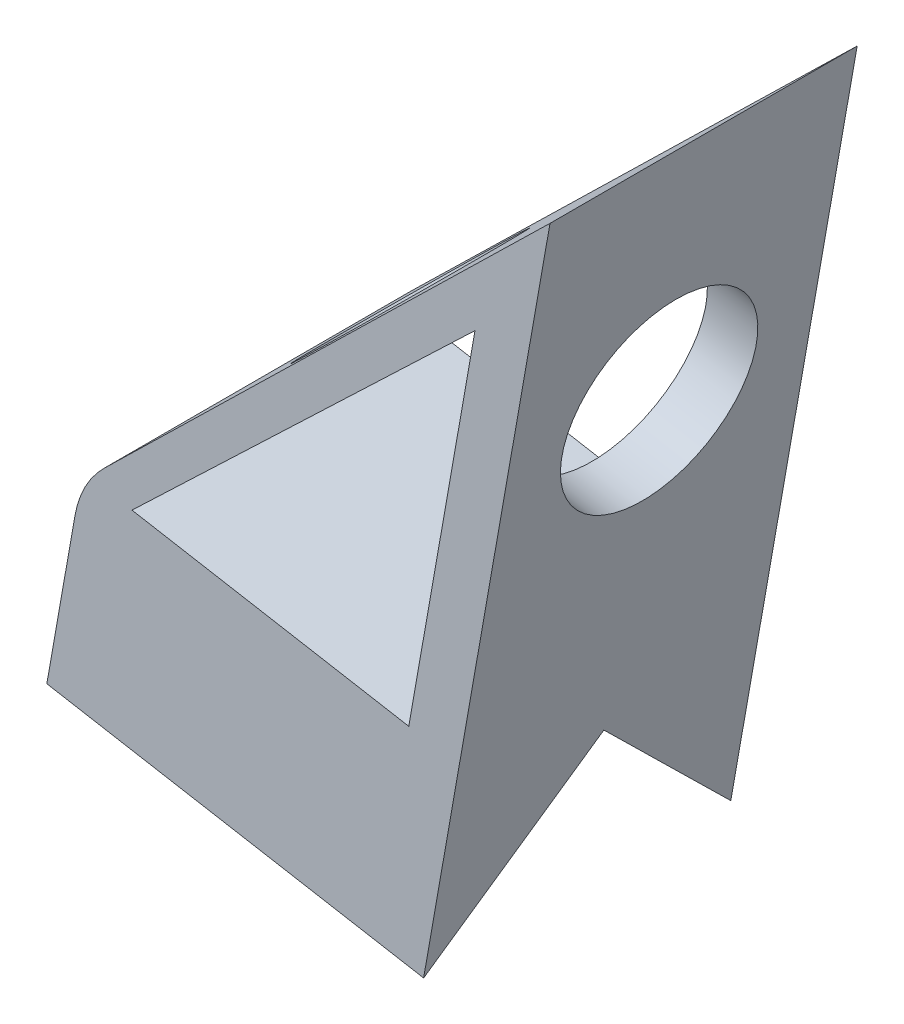
ISO-10303-21;
HEADER;
FILE_DESCRIPTION(('STEP AP214'),'2;1');
FILE_NAME('part.step','',(''),(''),'','','');
FILE_SCHEMA(('AUTOMOTIVE_DESIGN { 1 0 10303 214 1 1 1 1 }'));
ENDSEC;
DATA;
#1=APPLICATION_CONTEXT('core data for automotive mechanical design processes');
#2=APPLICATION_PROTOCOL_DEFINITION('international standard','automotive_design',2000,#1);
#3=PRODUCT_CONTEXT('',#1,'mechanical');
#4=PRODUCT('Part','Part','',(#3));
#5=PRODUCT_RELATED_PRODUCT_CATEGORY('part','',(#4));
#6=PRODUCT_DEFINITION_FORMATION('','',#4);
#7=PRODUCT_DEFINITION_CONTEXT('part definition',#1,'design');
#8=PRODUCT_DEFINITION('design','',#6,#7);
#9=PRODUCT_DEFINITION_SHAPE('','',#8);
#10=(LENGTH_UNIT() NAMED_UNIT(*) SI_UNIT(.MILLI.,.METRE.));
#11=(NAMED_UNIT(*) PLANE_ANGLE_UNIT() SI_UNIT($,.RADIAN.));
#12=(NAMED_UNIT(*) SI_UNIT($,.STERADIAN.) SOLID_ANGLE_UNIT());
#13=UNCERTAINTY_MEASURE_WITH_UNIT(LENGTH_MEASURE(1.E-05),#10,'distance_accuracy_value','');
#14=(GEOMETRIC_REPRESENTATION_CONTEXT(3) GLOBAL_UNCERTAINTY_ASSIGNED_CONTEXT((#13)) GLOBAL_UNIT_ASSIGNED_CONTEXT((#10,
#11,#12)) REPRESENTATION_CONTEXT('',''));
#15=CARTESIAN_POINT('',(0.,0.,0.));
#16=DIRECTION('',(0.,0.,1.));
#17=DIRECTION('',(1.,0.,0.));
#18=AXIS2_PLACEMENT_3D('',#15,#16,#17);
#19=CARTESIAN_POINT('',(0.,203.2,-76.2));
#20=DIRECTION('',(-0.698327101338565,0.715778778349901,0.));
#21=DIRECTION('',(-0.715778778349901,-0.698327101338565,0.));
#22=AXIS2_PLACEMENT_3D('',#19,#20,#21);
#23=PLANE('',#22);
#24=CARTESIAN_POINT('',(-72.7649377372775,132.209172126762,-38.1));
#25=DIRECTION('',(-0.698327101338565,0.715778778349901,0.));
#26=DIRECTION('',(-0.715778778349901,-0.698327101338565,0.));
#27=AXIS2_PLACEMENT_3D('',#24,#25,#26);
#28=CIRCLE('',#27,24.1299999999999);
#29=CARTESIAN_POINT('',(-90.0366796588606,115.358539171463,-38.1));
#30=VERTEX_POINT('',#29);
#31=EDGE_CURVE('E314',#30,#30,#28,.T.);
#32=ORIENTED_EDGE('',*,*,#31,.F.);
#33=EDGE_LOOP('',(#32));
#34=FACE_BOUND('',#33,.T.);
#35=DIRECTION('',(-0.715778778349901,-0.698327101338565,0.));
#36=VECTOR('',#35,1.);
#37=CARTESIAN_POINT('',(0.,203.2,-76.2));
#38=LINE('',#37,#36);
#39=CARTESIAN_POINT('',(0.,203.2,-76.2));
#40=VERTEX_POINT('',#39);
#41=CARTESIAN_POINT('',(-110.542859595178,95.3523282755936,-76.2));
#42=VERTEX_POINT('',#41);
#43=EDGE_CURVE('E201',#40,#42,#38,.T.);
#44=ORIENTED_EDGE('',*,*,#43,.T.);
#45=DIRECTION('',(0.,0.,1.));
#46=VECTOR('',#45,1.);
#47=CARTESIAN_POINT('',(-110.542859595178,95.3523282755936,0.));
#48=LINE('',#47,#46);
#49=CARTESIAN_POINT('',(-110.542859595178,95.3523282755936,0.));
#50=VERTEX_POINT('',#49);
#51=EDGE_CURVE('E223',#42,#50,#48,.T.);
#52=ORIENTED_EDGE('',*,*,#51,.T.);
#53=DIRECTION('',(-0.715778778349901,-0.698327101338565,0.));
#54=VECTOR('',#53,1.);
#55=CARTESIAN_POINT('',(0.,203.2,0.));
#56=LINE('',#55,#54);
#57=CARTESIAN_POINT('',(0.,203.2,0.));
#58=VERTEX_POINT('',#57);
#59=EDGE_CURVE('E194',#58,#50,#56,.T.);
#60=ORIENTED_EDGE('',*,*,#59,.F.);
#61=DIRECTION('',(0.,0.,1.));
#62=VECTOR('',#61,1.);
#63=CARTESIAN_POINT('',(0.,203.2,-76.2));
#64=LINE('',#63,#62);
#65=EDGE_CURVE('E213',#40,#58,#64,.T.);
#66=ORIENTED_EDGE('',*,*,#65,.F.);
#67=EDGE_LOOP('',(#44,#52,#60,#66));
#68=FACE_BOUND('',#67,.T.);
#69=ADVANCED_FACE('F59',(#34,#68),#23,.T.);
#70=CARTESIAN_POINT('',(0.,203.2,-76.2));
#71=DIRECTION('',(0.984807753012209,-0.173648177666923,0.));
#72=DIRECTION('',(0.173648177666923,0.984807753012209,0.));
#73=AXIS2_PLACEMENT_3D('',#70,#71,#72);
#74=PLANE('',#73);
#75=CARTESIAN_POINT('',(-11.0266592818496,140.664707683725,-38.1));
#76=DIRECTION('',(0.984807753012209,-0.173648177666923,0.));
#77=DIRECTION('',(0.173648177666923,0.984807753012209,0.));
#78=AXIS2_PLACEMENT_3D('',#75,#76,#77);
#79=CIRCLE('',#78,24.13);
#80=CARTESIAN_POINT('',(-6.83652875474678,164.428118763909,-38.1));
#81=VERTEX_POINT('',#80);
#82=EDGE_CURVE('E323',#81,#81,#79,.T.);
#83=ORIENTED_EDGE('',*,*,#82,.F.);
#84=EDGE_LOOP('',(#83));
#85=FACE_BOUND('',#84,.T.);
#86=DIRECTION('',(0.122787803968968,0.696364240320021,0.707106781186546));
#87=VECTOR('',#86,1.);
#88=CARTESIAN_POINT('',(-15.6754685849818,114.3,14.0714257966427));
#89=LINE('',#88,#87);
#90=CARTESIAN_POINT('',(-31.3509371699641,25.4,-76.2));
#91=VERTEX_POINT('',#90);
#92=CARTESIAN_POINT('',(-24.734941600854,62.9211753897652,-38.1));
#93=VERTEX_POINT('',#92);
#94=EDGE_CURVE('E136',#91,#93,#89,.T.);
#95=ORIENTED_EDGE('',*,*,#94,.F.);
#96=DIRECTION('',(0.173648177666923,0.984807753012209,0.));
#97=VECTOR('',#96,1.);
#98=CARTESIAN_POINT('',(0.,203.2,-76.2));
#99=LINE('',#98,#97);
#100=EDGE_CURVE('E209',#91,#40,#99,.T.);
#101=ORIENTED_EDGE('',*,*,#100,.T.);
#102=ORIENTED_EDGE('',*,*,#65,.T.);
#103=DIRECTION('',(0.173648177666923,0.984807753012209,0.));
#104=VECTOR('',#103,1.);
#105=CARTESIAN_POINT('',(0.,203.2,0.));
#106=LINE('',#105,#104);
#107=CARTESIAN_POINT('',(-31.3509371699642,25.4,0.));
#108=VERTEX_POINT('',#107);
#109=EDGE_CURVE('E206',#108,#58,#106,.T.);
#110=ORIENTED_EDGE('',*,*,#109,.F.);
#111=DIRECTION('',(-0.122787803968968,-0.696364240320021,0.707106781186546));
#112=VECTOR('',#111,1.);
#113=CARTESIAN_POINT('',(-9.05947301587205,151.821175389766,-128.371425796643));
#114=LINE('',#113,#112);
#115=EDGE_CURVE('E140',#93,#108,#114,.T.);
#116=ORIENTED_EDGE('',*,*,#115,.F.);
#117=EDGE_LOOP('',(#95,#101,#102,#110,#116));
#118=FACE_BOUND('',#117,.T.);
#119=ADVANCED_FACE('F263',(#85,#118),#74,.T.);
#120=CARTESIAN_POINT('',(0.,0.,-76.2));
#121=DIRECTION('',(0.,0.,-1.));
#122=DIRECTION('',(-1.,0.,0.));
#123=AXIS2_PLACEMENT_3D('',#120,#121,#122);
#124=PLANE('',#123);
#125=DIRECTION('',(0.17364817766693,0.984807753012208,0.));
#126=VECTOR('',#125,1.);
#127=CARTESIAN_POINT('',(-124.819846836216,41.8810906315625,-76.2));
#128=LINE('',#127,#126);
#129=CARTESIAN_POINT('',(-124.819846836216,41.8810906315625,-76.2));
#130=VERTEX_POINT('',#129);
#131=CARTESIAN_POINT('',(-117.819468147689,81.5822110182461,-76.2));
#132=VERTEX_POINT('',#131);
#133=EDGE_CURVE('E151',#130,#132,#128,.T.);
#134=ORIENTED_EDGE('',*,*,#133,.T.);
#135=CARTESIAN_POINT('',(-92.8053512211786,77.1715473055061,-76.2));
#136=DIRECTION('',(0.,0.,-1.));
#137=DIRECTION('',(-1.,0.,0.));
#138=AXIS2_PLACEMENT_3D('',#135,#136,#137);
#139=CIRCLE('',#138,25.4);
#140=EDGE_CURVE('E13',#132,#42,#139,.T.);
#141=ORIENTED_EDGE('',*,*,#140,.T.);
#142=ORIENTED_EDGE('',*,*,#43,.F.);
#143=ORIENTED_EDGE('',*,*,#100,.F.);
#144=DIRECTION('',(0.984807753012208,-0.173648177666931,0.));
#145=VECTOR('',#144,1.);
#146=CARTESIAN_POINT('',(-31.3509371699638,25.4,-76.2));
#147=LINE('',#146,#145);
#148=EDGE_CURVE('E205',#130,#91,#147,.T.);
#149=ORIENTED_EDGE('',*,*,#148,.F.);
#150=EDGE_LOOP('',(#134,#141,#142,#143,#149));
#151=FACE_BOUND('',#150,.T.);
#152=DIRECTION('',(-0.723833267678773,-0.689974927516551,0.));
#153=VECTOR('',#152,1.);
#154=CARTESIAN_POINT('',(-18.5981641131837,170.860955122557,-76.2));
#155=LINE('',#154,#153);
#156=CARTESIAN_POINT('',(-18.5981641131837,170.860955122557,-76.2));
#157=VERTEX_POINT('',#156);
#158=CARTESIAN_POINT('',(-103.69921746201,89.7406257071421,-76.2));
#159=VERTEX_POINT('',#158);
#160=EDGE_CURVE('E168',#157,#159,#155,.T.);
#161=ORIENTED_EDGE('',*,*,#160,.T.);
#162=DIRECTION('',(0.984807753012208,-0.173648177666931,0.));
#163=VECTOR('',#162,1.);
#164=CARTESIAN_POINT('',(-35.0366682077391,77.6335657093902,-76.2));
#165=LINE('',#164,#163);
#166=CARTESIAN_POINT('',(-35.0366682077391,77.6335657093902,-76.2));
#167=VERTEX_POINT('',#166);
#168=EDGE_CURVE('E172',#159,#167,#165,.T.);
#169=ORIENTED_EDGE('',*,*,#168,.T.);
#170=DIRECTION('',(0.173648177666923,0.984807753012209,0.));
#171=VECTOR('',#170,1.);
#172=CARTESIAN_POINT('',(-18.5981641131837,170.860955122557,-76.2));
#173=LINE('',#172,#171);
#174=EDGE_CURVE('E177',#167,#157,#173,.T.);
#175=ORIENTED_EDGE('',*,*,#174,.T.);
#176=EDGE_LOOP('',(#161,#169,#175));
#177=FACE_BOUND('',#176,.T.);
#178=ADVANCED_FACE('F266',(#151,#177),#124,.T.);
#179=CARTESIAN_POINT('',(0.,0.,0.));
#180=DIRECTION('',(0.,0.,-1.));
#181=DIRECTION('',(-1.,0.,0.));
#182=AXIS2_PLACEMENT_3D('',#179,#180,#181);
#183=PLANE('',#182);
#184=DIRECTION('',(0.984807753012208,-0.173648177666931,0.));
#185=VECTOR('',#184,1.);
#186=CARTESIAN_POINT('',(-35.0366682077391,77.6335657093902,0.));
#187=LINE('',#186,#185);
#188=CARTESIAN_POINT('',(-103.69921746201,89.7406257071421,0.));
#189=VERTEX_POINT('',#188);
#190=CARTESIAN_POINT('',(-35.0366682077391,77.6335657093902,0.));
#191=VERTEX_POINT('',#190);
#192=EDGE_CURVE('E184',#189,#191,#187,.T.);
#193=ORIENTED_EDGE('',*,*,#192,.F.);
#194=DIRECTION('',(-0.723833267678773,-0.689974927516551,0.));
#195=VECTOR('',#194,1.);
#196=CARTESIAN_POINT('',(-18.5981641131837,170.860955122557,0.));
#197=LINE('',#196,#195);
#198=CARTESIAN_POINT('',(-18.5981641131837,170.860955122557,0.));
#199=VERTEX_POINT('',#198);
#200=EDGE_CURVE('E165',#199,#189,#197,.T.);
#201=ORIENTED_EDGE('',*,*,#200,.F.);
#202=DIRECTION('',(0.173648177666923,0.984807753012209,0.));
#203=VECTOR('',#202,1.);
#204=CARTESIAN_POINT('',(-18.5981641131837,170.860955122557,0.));
#205=LINE('',#204,#203);
#206=EDGE_CURVE('E173',#191,#199,#205,.T.);
#207=ORIENTED_EDGE('',*,*,#206,.F.);
#208=EDGE_LOOP('',(#193,#201,#207));
#209=FACE_BOUND('',#208,.T.);
#210=ORIENTED_EDGE('',*,*,#59,.T.);
#211=CARTESIAN_POINT('',(-92.8053512211786,77.1715473055061,0.));
#212=DIRECTION('',(0.,0.,-1.));
#213=DIRECTION('',(-1.,0.,0.));
#214=AXIS2_PLACEMENT_3D('',#211,#212,#213);
#215=CIRCLE('',#214,25.4);
#216=CARTESIAN_POINT('',(-117.819468147689,81.5822110182461,0.));
#217=VERTEX_POINT('',#216);
#218=EDGE_CURVE('E82',#50,#217,#215,.F.);
#219=ORIENTED_EDGE('',*,*,#218,.T.);
#220=DIRECTION('',(0.17364817766693,0.984807753012208,0.));
#221=VECTOR('',#220,1.);
#222=CARTESIAN_POINT('',(-124.819846836216,41.8810906315625,0.));
#223=LINE('',#222,#221);
#224=CARTESIAN_POINT('',(-124.819846836216,41.8810906315625,0.));
#225=VERTEX_POINT('',#224);
#226=EDGE_CURVE('E162',#225,#217,#223,.T.);
#227=ORIENTED_EDGE('',*,*,#226,.F.);
#228=DIRECTION('',(0.984807753012208,-0.173648177666931,0.));
#229=VECTOR('',#228,1.);
#230=CARTESIAN_POINT('',(-31.3509371699638,25.4,0.));
#231=LINE('',#230,#229);
#232=EDGE_CURVE('E146',#225,#108,#231,.T.);
#233=ORIENTED_EDGE('',*,*,#232,.T.);
#234=ORIENTED_EDGE('',*,*,#109,.T.);
#235=EDGE_LOOP('',(#210,#219,#227,#233,#234));
#236=FACE_BOUND('',#235,.T.);
#237=ADVANCED_FACE('F260',(#209,#236),#183,.F.);
#238=CARTESIAN_POINT('',(-18.5981641131837,170.860955122557,-76.2));
#239=DIRECTION('',(-0.689974927516551,0.723833267678773,0.));
#240=DIRECTION('',(-0.723833267678773,-0.689974927516551,0.));
#241=AXIS2_PLACEMENT_3D('',#238,#239,#240);
#242=PLANE('',#241);
#243=CARTESIAN_POINT('',(-66.2028264809484,125.483069173794,-38.1));
#244=DIRECTION('',(-0.689974927516551,0.723833267678773,0.));
#245=DIRECTION('',(-0.723833267678773,-0.689974927516551,0.));
#246=AXIS2_PLACEMENT_3D('',#243,#244,#245);
#247=ELLIPSE('',#246,24.1316244638089,24.1299999999999);
#248=CARTESIAN_POINT('',(-83.6700990709842,108.83285333352,-38.1));
#249=VERTEX_POINT('',#248);
#250=EDGE_CURVE('E148',#249,#249,#247,.F.);
#251=ORIENTED_EDGE('',*,*,#250,.F.);
#252=EDGE_LOOP('',(#251));
#253=FACE_BOUND('',#252,.T.);
#254=ORIENTED_EDGE('',*,*,#200,.T.);
#255=DIRECTION('',(0.,0.,1.));
#256=VECTOR('',#255,1.);
#257=CARTESIAN_POINT('',(-103.69921746201,89.7406257071421,-76.2));
#258=LINE('',#257,#256);
#259=EDGE_CURVE('E181',#159,#189,#258,.T.);
#260=ORIENTED_EDGE('',*,*,#259,.F.);
#261=ORIENTED_EDGE('',*,*,#160,.F.);
#262=DIRECTION('',(0.,0.,1.));
#263=VECTOR('',#262,1.);
#264=CARTESIAN_POINT('',(-18.5981641131837,170.860955122557,-76.2));
#265=LINE('',#264,#263);
#266=EDGE_CURVE('E191',#157,#199,#265,.T.);
#267=ORIENTED_EDGE('',*,*,#266,.T.);
#268=EDGE_LOOP('',(#254,#260,#261,#267));
#269=FACE_BOUND('',#268,.T.);
#270=ADVANCED_FACE('F289',(#253,#269),#242,.F.);
#271=CARTESIAN_POINT('',(-18.5981641131837,170.860955122557,-76.2));
#272=DIRECTION('',(0.984807753012209,-0.173648177666923,0.));
#273=DIRECTION('',(0.173648177666923,0.984807753012209,0.));
#274=AXIS2_PLACEMENT_3D('',#271,#272,#273);
#275=PLANE('',#274);
#276=CARTESIAN_POINT('',(-23.5337177451047,142.870039540095,-38.1));
#277=DIRECTION('',(0.984807753012209,-0.173648177666923,0.));
#278=DIRECTION('',(0.173648177666923,0.984807753012209,0.));
#279=AXIS2_PLACEMENT_3D('',#276,#277,#278);
#280=CIRCLE('',#279,24.13);
#281=CARTESIAN_POINT('',(-19.3435872180018,166.633450620279,-38.1));
#282=VERTEX_POINT('',#281);
#283=EDGE_CURVE('E321',#282,#282,#280,.F.);
#284=ORIENTED_EDGE('',*,*,#283,.F.);
#285=EDGE_LOOP('',(#284));
#286=FACE_BOUND('',#285,.T.);
#287=ORIENTED_EDGE('',*,*,#206,.T.);
#288=ORIENTED_EDGE('',*,*,#266,.F.);
#289=ORIENTED_EDGE('',*,*,#174,.F.);
#290=DIRECTION('',(0.,0.,1.));
#291=VECTOR('',#290,1.);
#292=CARTESIAN_POINT('',(-35.0366682077391,77.6335657093902,-76.2));
#293=LINE('',#292,#291);
#294=EDGE_CURVE('E195',#167,#191,#293,.T.);
#295=ORIENTED_EDGE('',*,*,#294,.T.);
#296=EDGE_LOOP('',(#287,#288,#289,#295));
#297=FACE_BOUND('',#296,.T.);
#298=ADVANCED_FACE('F294',(#286,#297),#275,.F.);
#299=CARTESIAN_POINT('',(-35.0366682077391,77.6335657093902,-76.2));
#300=DIRECTION('',(-0.173648177666931,-0.984807753012208,0.));
#301=DIRECTION('',(0.984807753012208,-0.173648177666931,0.));
#302=AXIS2_PLACEMENT_3D('',#299,#300,#301);
#303=PLANE('',#302);
#304=ORIENTED_EDGE('',*,*,#192,.T.);
#305=ORIENTED_EDGE('',*,*,#294,.F.);
#306=ORIENTED_EDGE('',*,*,#168,.F.);
#307=ORIENTED_EDGE('',*,*,#259,.T.);
#308=EDGE_LOOP('',(#304,#305,#306,#307));
#309=FACE_BOUND('',#308,.T.);
#310=ADVANCED_FACE('F296',(#309),#303,.F.);
#311=CARTESIAN_POINT('',(-124.819846836216,41.8810906315625,-76.2));
#312=DIRECTION('',(0.984807753012208,-0.17364817766693,0.));
#313=DIRECTION('',(0.17364817766693,0.984807753012208,0.));
#314=AXIS2_PLACEMENT_3D('',#311,#312,#313);
#315=PLANE('',#314);
#316=ORIENTED_EDGE('',*,*,#226,.T.);
#317=DIRECTION('',(0.,0.,1.));
#318=VECTOR('',#317,1.);
#319=CARTESIAN_POINT('',(-117.819468147689,81.5822110182462,-76.2));
#320=LINE('',#319,#318);
#321=EDGE_CURVE('E68',#217,#132,#320,.F.);
#322=ORIENTED_EDGE('',*,*,#321,.T.);
#323=ORIENTED_EDGE('',*,*,#133,.F.);
#324=DIRECTION('',(-0.122787803968973,-0.69636424032002,-0.707106781186546));
#325=VECTOR('',#324,1.);
#326=CARTESIAN_POINT('',(-124.819846836216,41.8810906315625,-76.2));
#327=LINE('',#326,#325);
#328=CARTESIAN_POINT('',(-118.203851267106,79.4022660213278,-38.1));
#329=VERTEX_POINT('',#328);
#330=EDGE_CURVE('E134',#329,#130,#327,.T.);
#331=ORIENTED_EDGE('',*,*,#330,.F.);
#332=DIRECTION('',(0.122787803968973,0.69636424032002,-0.707106781186546));
#333=VECTOR('',#332,1.);
#334=CARTESIAN_POINT('',(-118.203851267106,79.4022660213278,-38.1));
#335=LINE('',#334,#333);
#336=EDGE_CURVE('E143',#225,#329,#335,.T.);
#337=ORIENTED_EDGE('',*,*,#336,.F.);
#338=EDGE_LOOP('',(#316,#322,#323,#331,#337));
#339=FACE_BOUND('',#338,.T.);
#340=ADVANCED_FACE('F150',(#339),#315,.F.);
#341=CARTESIAN_POINT('',(-0.945346428313079,20.0386739878674,-76.2));
#342=DIRECTION('',(0.122787803968973,0.696364240320017,-0.707106781186549));
#343=DIRECTION('',(0.,0.712498293208671,0.701673843159862));
#344=AXIS2_PLACEMENT_3D('',#341,#342,#343);
#345=PLANE('',#344);
#346=ORIENTED_EDGE('',*,*,#94,.T.);
#347=DIRECTION('',(-0.984807753012208,0.173648177666931,0.));
#348=VECTOR('',#347,1.);
#349=CARTESIAN_POINT('',(5.67064914079701,57.5598493776327,-38.1));
#350=LINE('',#349,#348);
#351=EDGE_CURVE('E130',#93,#329,#350,.T.);
#352=ORIENTED_EDGE('',*,*,#351,.T.);
#353=ORIENTED_EDGE('',*,*,#330,.T.);
#354=ORIENTED_EDGE('',*,*,#148,.T.);
#355=EDGE_LOOP('',(#346,#352,#353,#354));
#356=FACE_BOUND('',#355,.T.);
#357=ADVANCED_FACE('F132',(#356),#345,.F.);
#358=CARTESIAN_POINT('',(5.67064914079701,57.5598493776327,-38.1));
#359=DIRECTION('',(0.122787803968973,0.696364240320017,0.707106781186549));
#360=DIRECTION('',(0.,-0.712498293208671,0.701673843159862));
#361=AXIS2_PLACEMENT_3D('',#358,#359,#360);
#362=PLANE('',#361);
#363=ORIENTED_EDGE('',*,*,#115,.T.);
#364=ORIENTED_EDGE('',*,*,#232,.F.);
#365=ORIENTED_EDGE('',*,*,#336,.T.);
#366=ORIENTED_EDGE('',*,*,#351,.F.);
#367=EDGE_LOOP('',(#363,#364,#365,#366));
#368=FACE_BOUND('',#367,.T.);
#369=ADVANCED_FACE('F144',(#368),#362,.F.);
#370=CARTESIAN_POINT('',(16.1089742955703,41.1142395942688,-38.1));
#371=DIRECTION('',(-0.698327101338565,0.715778778349901,0.));
#372=DIRECTION('',(-0.715778778349901,-0.698327101338565,0.));
#373=AXIS2_PLACEMENT_3D('',#370,#371,#372);
#374=CYLINDRICAL_SURFACE('',#373,24.1299999999999);
#375=ORIENTED_EDGE('',*,*,#31,.T.);
#376=EDGE_LOOP('',(#375));
#377=FACE_BOUND('',#376,.T.);
#378=ORIENTED_EDGE('',*,*,#250,.T.);
#379=EDGE_LOOP('',(#378));
#380=FACE_BOUND('',#379,.T.);
#381=ADVANCED_FACE('F274',(#377,#380),#374,.F.);
#382=CARTESIAN_POINT('',(-132.08386805615,162.01035979989,-38.1));
#383=DIRECTION('',(0.984807753012209,-0.173648177666923,0.));
#384=DIRECTION('',(0.173648177666923,0.984807753012209,0.));
#385=AXIS2_PLACEMENT_3D('',#382,#383,#384);
#386=CYLINDRICAL_SURFACE('',#385,24.13);
#387=ORIENTED_EDGE('',*,*,#82,.T.);
#388=EDGE_LOOP('',(#387));
#389=FACE_BOUND('',#388,.T.);
#390=ORIENTED_EDGE('',*,*,#283,.T.);
#391=EDGE_LOOP('',(#390));
#392=FACE_BOUND('',#391,.T.);
#393=ADVANCED_FACE('F269',(#389,#392),#386,.F.);
#394=CARTESIAN_POINT('',(-92.8053512211786,77.1715473055061,-76.2));
#395=DIRECTION('',(0.,0.,-1.));
#396=DIRECTION('',(-1.,0.,0.));
#397=AXIS2_PLACEMENT_3D('',#394,#395,#396);
#398=CYLINDRICAL_SURFACE('',#397,25.4);
#399=ORIENTED_EDGE('',*,*,#140,.F.);
#400=ORIENTED_EDGE('',*,*,#321,.F.);
#401=ORIENTED_EDGE('',*,*,#218,.F.);
#402=ORIENTED_EDGE('',*,*,#51,.F.);
#403=EDGE_LOOP('',(#399,#400,#401,#402));
#404=FACE_BOUND('',#403,.T.);
#405=ADVANCED_FACE('F61',(#404),#398,.T.);
#406=CLOSED_SHELL('',(#69,#119,#178,#237,#270,#298,#310,#340,#357,#369,#381,#393,#405));
#407=MANIFOLD_SOLID_BREP('B2',#406);
#408=ADVANCED_BREP_SHAPE_REPRESENTATION('',(#18,#407),#14);
#409=SHAPE_DEFINITION_REPRESENTATION(#9,#408);
ENDSEC;
END-ISO-10303-21;
